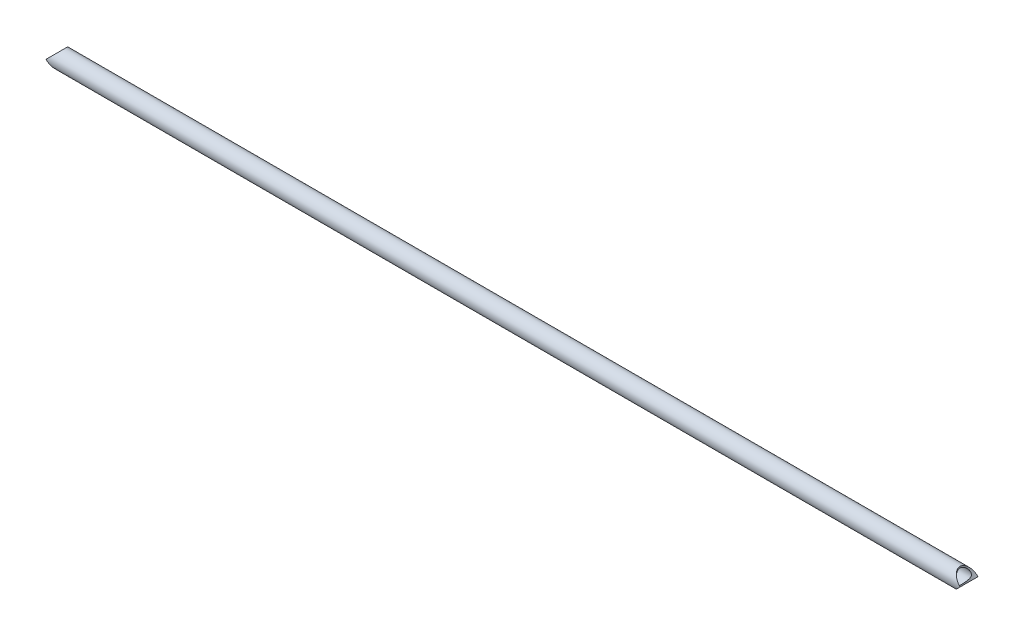
ISO-10303-21;
HEADER;
FILE_DESCRIPTION(('STEP AP214'),'2;1');
FILE_NAME('part.step','',(''),(''),'','','');
FILE_SCHEMA(('AUTOMOTIVE_DESIGN { 1 0 10303 214 1 1 1 1 }'));
ENDSEC;
DATA;
#1=APPLICATION_CONTEXT('core data for automotive mechanical design processes');
#2=APPLICATION_PROTOCOL_DEFINITION('international standard','automotive_design',2000,#1);
#3=PRODUCT_CONTEXT('',#1,'mechanical');
#4=PRODUCT('Part','Part','',(#3));
#5=PRODUCT_RELATED_PRODUCT_CATEGORY('part','',(#4));
#6=PRODUCT_DEFINITION_FORMATION('','',#4);
#7=PRODUCT_DEFINITION_CONTEXT('part definition',#1,'design');
#8=PRODUCT_DEFINITION('design','',#6,#7);
#9=PRODUCT_DEFINITION_SHAPE('','',#8);
#10=(LENGTH_UNIT() NAMED_UNIT(*) SI_UNIT(.MILLI.,.METRE.));
#11=(NAMED_UNIT(*) PLANE_ANGLE_UNIT() SI_UNIT($,.RADIAN.));
#12=(NAMED_UNIT(*) SI_UNIT($,.STERADIAN.) SOLID_ANGLE_UNIT());
#13=UNCERTAINTY_MEASURE_WITH_UNIT(LENGTH_MEASURE(1.E-05),#10,'distance_accuracy_value','');
#14=(GEOMETRIC_REPRESENTATION_CONTEXT(3) GLOBAL_UNCERTAINTY_ASSIGNED_CONTEXT((#13)) GLOBAL_UNIT_ASSIGNED_CONTEXT((#10,
#11,#12)) REPRESENTATION_CONTEXT('',''));
#15=CARTESIAN_POINT('',(0.,0.,0.));
#16=DIRECTION('',(0.,0.,1.));
#17=DIRECTION('',(1.,0.,0.));
#18=AXIS2_PLACEMENT_3D('',#15,#16,#17);
#19=CARTESIAN_POINT('',(0.,0.,0.));
#20=DIRECTION('',(1.,0.,0.));
#21=DIRECTION('',(0.,0.,-1.));
#22=AXIS2_PLACEMENT_3D('',#19,#20,#21);
#23=CYLINDRICAL_SURFACE('',#22,17.526);
#24=CARTESIAN_POINT('',(21.082,-17.526,0.));
#25=CARTESIAN_POINT('',(21.0819981302831,-17.5259980790686,0.416631891884529));
#26=CARTESIAN_POINT('',(21.0696232973525,-17.5111180143844,0.833291614596574));
#27=CARTESIAN_POINT('',(21.0204123868294,-17.4518754486312,1.66306415209241));
#28=CARTESIAN_POINT('',(20.9835740691353,-17.4075102476317,2.07617663854929));
#29=CARTESIAN_POINT('',(20.8862655224406,-17.2900872977812,2.89568705974647));
#30=CARTESIAN_POINT('',(20.8257826629877,-17.2170142136367,3.30208128458832));
#31=CARTESIAN_POINT('',(20.6825199963858,-17.0434440095406,4.10492258594921));
#32=CARTESIAN_POINT('',(20.5997402057583,-16.9429469099098,4.50136966983866));
#33=CARTESIAN_POINT('',(20.4141431070437,-16.7167980768224,5.27944200995072));
#34=CARTESIAN_POINT('',(20.3114495374411,-16.5913015575225,5.66114217998166));
#35=CARTESIAN_POINT('',(20.0876164579014,-16.3165142511288,6.41024393360111));
#36=CARTESIAN_POINT('',(19.9664773273835,-16.1672239534624,6.77764581110572));
#37=CARTESIAN_POINT('',(19.70776489957,-15.8466059374724,7.49671581118125));
#38=CARTESIAN_POINT('',(19.5701899757762,-15.6752760379645,7.84838237183241));
#39=CARTESIAN_POINT('',(19.2806731307627,-15.3122919872886,8.53494244045511));
#40=CARTESIAN_POINT('',(19.1287281642061,-15.1206335269885,8.86983236997341));
#41=CARTESIAN_POINT('',(18.7546096768725,-14.6449371899327,9.64160148099856));
#42=CARTESIAN_POINT('',(18.5270967401216,-14.35277428092,10.0709122769917));
#43=CARTESIAN_POINT('',(18.0542605595369,-13.7370016154288,10.8958994551619));
#44=CARTESIAN_POINT('',(17.8089313166323,-13.4133812541277,11.2915644099101));
#45=CARTESIAN_POINT('',(17.3049499195868,-12.7366562994745,12.0497774892056));
#46=CARTESIAN_POINT('',(17.0462656815009,-12.3834793039229,12.4122394487072));
#47=CARTESIAN_POINT('',(16.5213575682595,-11.6503539028584,13.1028064141256));
#48=CARTESIAN_POINT('',(16.2551346410727,-11.2704088544898,13.4309157156317));
#49=CARTESIAN_POINT('',(15.7157329552894,-10.4776074832354,14.058474508539));
#50=CARTESIAN_POINT('',(15.4425158851042,-10.0642773274174,14.3572922158469));
#51=CARTESIAN_POINT('',(14.9004362017554,-9.21095417180201,14.9191173098571));
#52=CARTESIAN_POINT('',(14.631575071631,-8.77095232335846,15.1821127170899));
#53=CARTESIAN_POINT('',(14.1070581038938,-7.86481771696898,15.6706644706901));
#54=CARTESIAN_POINT('',(13.8513718737821,-7.39875079698375,15.8963099105176));
#55=CARTESIAN_POINT('',(13.3630798731292,-6.43838011624403,16.3089150152554));
#56=CARTESIAN_POINT('',(13.1304544791627,-5.94410093685271,16.4959077210257));
#57=CARTESIAN_POINT('',(12.7988575900592,-5.15602713461917,16.7529770183563));
#58=CARTESIAN_POINT('',(12.6869431717587,-4.87241122579883,16.8377355356669));
#59=CARTESIAN_POINT('',(12.477044564201,-4.29634478402693,16.9938564640281));
#60=CARTESIAN_POINT('',(12.3790621781023,-4.00389311343181,17.0652171414406));
#61=CARTESIAN_POINT('',(12.2002966712012,-3.4112731010736,17.1934753974398));
#62=CARTESIAN_POINT('',(12.1194800845942,-3.11112107688252,17.2504011606098));
#63=CARTESIAN_POINT('',(11.9779668666245,-2.50374825167055,17.3489622221163));
#64=CARTESIAN_POINT('',(11.9172596505075,-2.1965312607242,17.3906055657459));
#65=CARTESIAN_POINT('',(11.818107689882,-1.57275030198951,17.4581423992254));
#66=CARTESIAN_POINT('',(11.779951954164,-1.2561174134265,17.4838316318924));
#67=CARTESIAN_POINT('',(11.7291856587467,-0.619878138777139,17.5179303907999));
#68=CARTESIAN_POINT('',(11.7165727975296,-0.300272023197923,17.5263414738735));
#69=CARTESIAN_POINT('',(11.7176262308081,0.338899727230871,17.5256372420332));
#70=CARTESIAN_POINT('',(11.731294246306,0.658465358058826,17.5165207793285));
#71=CARTESIAN_POINT('',(11.7841114051786,1.29450954509332,17.4810304641374));
#72=CARTESIAN_POINT('',(11.8232637069628,1.61098771371825,17.4546544725793));
#73=CARTESIAN_POINT('',(11.9294258258338,2.26597232429025,17.3822894554488));
#74=CARTESIAN_POINT('',(11.9985895138348,2.60395741877091,17.334774736316));
#75=CARTESIAN_POINT('',(12.1607700214953,3.27094353248153,17.221385971186));
#76=CARTESIAN_POINT('',(12.253790706483,3.59994308630083,17.1555089499647));
#77=CARTESIAN_POINT('',(12.4597518747192,4.24855969720269,17.0065124919798));
#78=CARTESIAN_POINT('',(12.5727445713628,4.56814953492199,16.9233477565931));
#79=CARTESIAN_POINT('',(12.8144967287314,5.19667656849724,16.7410381014441));
#80=CARTESIAN_POINT('',(12.9432623370335,5.50560955027848,16.6418869460964));
#81=CARTESIAN_POINT('',(13.2916030159056,6.28987347341688,16.3663636493324));
#82=CARTESIAN_POINT('',(13.5203444227361,6.75718025521281,16.1786782502658));
#83=CARTESIAN_POINT('',(13.9967739769094,7.66612078661562,15.7683261665334));
#84=CARTESIAN_POINT('',(14.2444730476708,8.10773947286392,15.5456392349102));
#85=CARTESIAN_POINT('',(14.7503773701628,8.966836910621,15.066475124559));
#86=CARTESIAN_POINT('',(15.008596305603,9.38428239246995,14.8099528974554));
#87=CARTESIAN_POINT('',(15.5282832728022,10.1948090672196,14.264122868425));
#88=CARTESIAN_POINT('',(15.789750648598,10.58789508607,13.9748215928149));
#89=CARTESIAN_POINT('',(16.3234130427938,11.3687731946263,13.3482093999188));
#90=CARTESIAN_POINT('',(16.595485056072,11.7553013794754,13.0092142605656));
#91=CARTESIAN_POINT('',(17.1311622254835,12.5001422324198,12.2952548941142));
#92=CARTESIAN_POINT('',(17.3947660938107,12.8584506208612,11.9202852303774));
#93=CARTESIAN_POINT('',(17.9075222183104,13.5440372996657,11.1351119046645));
#94=CARTESIAN_POINT('',(18.156699977354,13.8713710412073,10.7249738116483));
#95=CARTESIAN_POINT('',(18.5157566882301,14.337116723475,10.083528945835));
#96=CARTESIAN_POINT('',(18.6329792519374,14.4881418292696,9.8653649320548));
#97=CARTESIAN_POINT('',(18.8619033923324,14.7813992076686,9.4202948049645));
#98=CARTESIAN_POINT('',(18.9736036059451,14.9236293115641,9.19338655767707));
#99=CARTESIAN_POINT('',(19.245306332261,15.2678710636928,8.6148770358869));
#100=CARTESIAN_POINT('',(19.4013855378835,15.4640216769566,8.25789744735692));
#101=CARTESIAN_POINT('',(19.6969596498739,15.8332690112885,7.52571112583219));
#102=CARTESIAN_POINT('',(19.8364585509682,16.0063712866528,7.15050881408724));
#103=CARTESIAN_POINT('',(20.0964063845014,16.3274115103296,6.38349259773578));
#104=CARTESIAN_POINT('',(20.2168720667449,16.4753715932839,5.99169368811111));
#105=CARTESIAN_POINT('',(20.436574354194,16.7442387882183,5.1931259403282));
#106=CARTESIAN_POINT('',(20.5358135459414,16.8651491964034,4.78635893318676));
#107=CARTESIAN_POINT('',(20.6980175118539,17.0622544046955,4.02147552090746));
#108=CARTESIAN_POINT('',(20.7641757673935,17.1424168859823,3.66505417999647));
#109=CARTESIAN_POINT('',(20.8784528987765,17.2806615676892,2.94511781335948));
#110=CARTESIAN_POINT('',(20.9265738653773,17.3387463272168,2.5816036149305));
#111=CARTESIAN_POINT('',(21.0039231656528,17.4320228512749,1.84968454444555));
#112=CARTESIAN_POINT('',(21.0331534545224,17.4672169849997,1.48128018255334));
#113=CARTESIAN_POINT('',(21.0721936631951,17.5142075700851,0.741924734095827));
#114=CARTESIAN_POINT('',(21.0820016648156,17.5260017104175,0.370973399616664));
#115=CARTESIAN_POINT('',(21.081998130283,17.5259980790686,-0.416631891884526));
#116=CARTESIAN_POINT('',(21.0696232973525,17.5111180143844,-0.83329161459657));
#117=CARTESIAN_POINT('',(21.0204123868294,17.4518754486312,-1.6630641520924));
#118=CARTESIAN_POINT('',(20.9835740691353,17.4075102476317,-2.07617663854929));
#119=CARTESIAN_POINT('',(20.8862655224405,17.2900872977812,-2.89568705974647));
#120=CARTESIAN_POINT('',(20.8257826629877,17.2170142136367,-3.30208128458832));
#121=CARTESIAN_POINT('',(20.6825199963858,17.0434440095406,-4.10492258594921));
#122=CARTESIAN_POINT('',(20.5997402057583,16.9429469099098,-4.50136966983866));
#123=CARTESIAN_POINT('',(20.4141431070437,16.7167980768224,-5.27944200995071));
#124=CARTESIAN_POINT('',(20.3114495374411,16.5913015575225,-5.66114217998166));
#125=CARTESIAN_POINT('',(20.0876164579014,16.3165142511288,-6.41024393360111));
#126=CARTESIAN_POINT('',(19.9664773273835,16.1672239534624,-6.77764581110571));
#127=CARTESIAN_POINT('',(19.70776489957,15.8466059374724,-7.49671581118126));
#128=CARTESIAN_POINT('',(19.5701899757762,15.6752760379645,-7.84838237183241));
#129=CARTESIAN_POINT('',(19.2806731307627,15.3122919872886,-8.53494244045511));
#130=CARTESIAN_POINT('',(19.1287281642061,15.1206335269885,-8.86983236997341));
#131=CARTESIAN_POINT('',(18.7546096768725,14.6449371899327,-9.64160148099856));
#132=CARTESIAN_POINT('',(18.5270967401216,14.35277428092,-10.0709122769917));
#133=CARTESIAN_POINT('',(18.0542605595369,13.7370016154288,-10.8958994551619));
#134=CARTESIAN_POINT('',(17.8089313166323,13.4133812541277,-11.2915644099101));
#135=CARTESIAN_POINT('',(17.3049499195868,12.7366562994745,-12.0497774892056));
#136=CARTESIAN_POINT('',(17.0462656815009,12.3834793039229,-12.4122394487072));
#137=CARTESIAN_POINT('',(16.5213575682595,11.6503539028584,-13.1028064141256));
#138=CARTESIAN_POINT('',(16.2551346410727,11.2704088544898,-13.4309157156317));
#139=CARTESIAN_POINT('',(15.7157329552894,10.4776074832354,-14.058474508539));
#140=CARTESIAN_POINT('',(15.4425158851042,10.0642773274174,-14.3572922158469));
#141=CARTESIAN_POINT('',(14.9004362017554,9.21095417180201,-14.9191173098571));
#142=CARTESIAN_POINT('',(14.631575071631,8.77095232335846,-15.1821127170899));
#143=CARTESIAN_POINT('',(14.1070581038938,7.86481771696898,-15.6706644706901));
#144=CARTESIAN_POINT('',(13.8513718737821,7.39875079698376,-15.8963099105176));
#145=CARTESIAN_POINT('',(13.3630798731292,6.43838011624403,-16.3089150152554));
#146=CARTESIAN_POINT('',(13.1304544791627,5.94410093685271,-16.4959077210257));
#147=CARTESIAN_POINT('',(12.7988575900592,5.15602713461916,-16.7529770183563));
#148=CARTESIAN_POINT('',(12.6869431717587,4.87241122579883,-16.8377355356669));
#149=CARTESIAN_POINT('',(12.477044564201,4.29634478402693,-16.9938564640281));
#150=CARTESIAN_POINT('',(12.3790621781024,4.00389311343181,-17.0652171414406));
#151=CARTESIAN_POINT('',(12.2002966712012,3.41127310107359,-17.1934753974398));
#152=CARTESIAN_POINT('',(12.1194800845942,3.11112107688251,-17.2504011606098));
#153=CARTESIAN_POINT('',(11.9779668666245,2.50374825167054,-17.3489622221163));
#154=CARTESIAN_POINT('',(11.9172596505075,2.1965312607242,-17.3906055657459));
#155=CARTESIAN_POINT('',(11.818107689882,1.57275030198951,-17.4581423992254));
#156=CARTESIAN_POINT('',(11.779951954164,1.25611741342649,-17.4838316318924));
#157=CARTESIAN_POINT('',(11.7291856587467,0.619878138777128,-17.5179303907999));
#158=CARTESIAN_POINT('',(11.7165727975296,0.300272023197912,-17.5263414738735));
#159=CARTESIAN_POINT('',(11.7176262308081,-0.338899727230883,-17.5256372420332));
#160=CARTESIAN_POINT('',(11.731294246306,-0.658465358058837,-17.5165207793285));
#161=CARTESIAN_POINT('',(11.7841114051786,-1.29450954509333,-17.4810304641374));
#162=CARTESIAN_POINT('',(11.8232637069628,-1.61098771371825,-17.4546544725793));
#163=CARTESIAN_POINT('',(11.9294258258338,-2.26597232429026,-17.3822894554488));
#164=CARTESIAN_POINT('',(11.9985895138348,-2.60395741877093,-17.334774736316));
#165=CARTESIAN_POINT('',(12.1607700214953,-3.27094353248155,-17.221385971186));
#166=CARTESIAN_POINT('',(12.2537907064831,-3.59994308630085,-17.1555089499647));
#167=CARTESIAN_POINT('',(12.4597518747192,-4.24855969720271,-17.0065124919798));
#168=CARTESIAN_POINT('',(12.5727445713628,-4.568149534922,-16.9233477565931));
#169=CARTESIAN_POINT('',(12.8144967287314,-5.19667656849725,-16.741038101444));
#170=CARTESIAN_POINT('',(12.9432623370335,-5.50560955027849,-16.6418869460964));
#171=CARTESIAN_POINT('',(13.2916030159056,-6.28987347341688,-16.3663636493324));
#172=CARTESIAN_POINT('',(13.5203444227361,-6.75718025521282,-16.1786782502658));
#173=CARTESIAN_POINT('',(13.9967739769094,-7.66612078661563,-15.7683261665334));
#174=CARTESIAN_POINT('',(14.2444730476708,-8.10773947286393,-15.5456392349102));
#175=CARTESIAN_POINT('',(14.7503773701628,-8.966836910621,-15.066475124559));
#176=CARTESIAN_POINT('',(15.008596305603,-9.38428239246996,-14.8099528974554));
#177=CARTESIAN_POINT('',(15.5282832728022,-10.1948090672196,-14.2641228684251));
#178=CARTESIAN_POINT('',(15.789750648598,-10.58789508607,-13.9748215928149));
#179=CARTESIAN_POINT('',(16.3234130427938,-11.3687731946263,-13.3482093999188));
#180=CARTESIAN_POINT('',(16.595485056072,-11.7553013794754,-13.0092142605656));
#181=CARTESIAN_POINT('',(17.1311622254835,-12.5001422324198,-12.2952548941142));
#182=CARTESIAN_POINT('',(17.3947660938107,-12.8584506208612,-11.9202852303774));
#183=CARTESIAN_POINT('',(17.9075222183104,-13.5440372996657,-11.1351119046645));
#184=CARTESIAN_POINT('',(18.156699977354,-13.8713710412073,-10.7249738116483));
#185=CARTESIAN_POINT('',(18.5157566882301,-14.337116723475,-10.083528945835));
#186=CARTESIAN_POINT('',(18.6329792519374,-14.4881418292696,-9.8653649320548));
#187=CARTESIAN_POINT('',(18.8619033923324,-14.7813992076686,-9.4202948049645));
#188=CARTESIAN_POINT('',(18.9736036059451,-14.9236293115641,-9.19338655767707));
#189=CARTESIAN_POINT('',(19.245306332261,-15.2678710636928,-8.6148770358869));
#190=CARTESIAN_POINT('',(19.4013855378835,-15.4640216769566,-8.25789744735693));
#191=CARTESIAN_POINT('',(19.6969596498739,-15.8332690112885,-7.52571112583219));
#192=CARTESIAN_POINT('',(19.8364585509682,-16.0063712866528,-7.15050881408724));
#193=CARTESIAN_POINT('',(20.0964063845014,-16.3274115103296,-6.38349259773578));
#194=CARTESIAN_POINT('',(20.2168720667449,-16.4753715932839,-5.99169368811112));
#195=CARTESIAN_POINT('',(20.436574354194,-16.7442387882182,-5.1931259403282));
#196=CARTESIAN_POINT('',(20.5358135459414,-16.8651491964034,-4.78635893318676));
#197=CARTESIAN_POINT('',(20.6980175118538,-17.0622544046955,-4.02147552090746));
#198=CARTESIAN_POINT('',(20.7641757673935,-17.1424168859823,-3.66505417999648));
#199=CARTESIAN_POINT('',(20.8784528987765,-17.2806615676892,-2.94511781335949));
#200=CARTESIAN_POINT('',(20.9265738653773,-17.3387463272168,-2.5816036149305));
#201=CARTESIAN_POINT('',(21.0039231656528,-17.4320228512749,-1.84968454444556));
#202=CARTESIAN_POINT('',(21.0331534545224,-17.4672169849997,-1.48128018255334));
#203=CARTESIAN_POINT('',(21.0721936631951,-17.5142075700851,-0.741924734095828));
#204=CARTESIAN_POINT('',(21.0820016648155,-17.5260017104175,-0.370973399616663));
#205=CARTESIAN_POINT('',(21.082,-17.526,0.));
#206=B_SPLINE_CURVE_WITH_KNOTS('',3,(#24,#25,#26,#27,#28,#29,#30,#31,#32,#33,#34,#35,#36,#37,
#38,#39,#40,#41,#42,#43,#44,#45,#46,#47,#48,#49,#50,#51,#52,#53,#54,#55,#56,#57,#58,#59,#60,#61,
#62,#63,#64,#65,#66,#67,#68,#69,#70,#71,#72,#73,#74,#75,#76,#77,#78,#79,#80,#81,#82,#83,#84,#85,
#86,#87,#88,#89,#90,#91,#92,#93,#94,#95,#96,#97,#98,#99,#100,#101,#102,#103,#104,#105,#106,#107,
#108,#109,#110,#111,#112,#113,#114,#115,#116,#117,#118,#119,#120,#121,#122,#123,#124,#125,#126,
#127,#128,#129,#130,#131,#132,#133,#134,#135,#136,#137,#138,#139,#140,#141,#142,#143,#144,#145,
#146,#147,#148,#149,#150,#151,#152,#153,#154,#155,#156,#157,#158,#159,#160,#161,#162,#163,#164,
#165,#166,#167,#168,#169,#170,#171,#172,#173,#174,#175,#176,#177,#178,#179,#180,#181,#182,#183,
#184,#185,#186,#187,#188,#189,#190,#191,#192,#193,#194,#195,#196,#197,#198,#199,#200,#201,#202,
#203,#204,#205),.UNSPECIFIED.,.T.,.F.,(4,2,2,2,2,2,2,2,2,2,2,2,2,2,2,2,2,2,2,2,2,2,2,2,2,2,2,2,
2,2,2,2,2,2,2,2,2,2,2,2,2,2,2,2,2,2,2,2,2,2,2,2,2,2,2,2,2,2,2,2,2,2,2,2,2,2,2,2,2,2,2,2,2,2,2,2,
2,2,2,2,2,2,2,2,2,2,2,2,2,2,4),(0.,1.24949934855756,2.49911312853975,3.74939534191412,
4.99967662885311,6.24242452622056,7.48514686411975,8.72799228476734,9.97110168518414,
11.669501012606,13.3684748971782,15.0717397764303,16.7747914178441,18.5089011871743,
20.243589450297,21.974078274241,23.7030816801075,24.6518793393344,25.600799685493,
26.5478527179048,27.4944064650862,28.4528415801625,29.4111903324619,30.3696018443357,
31.328132160104,32.3712695138644,33.4145759843964,34.4606514688156,35.5071359718705,
37.1638896134146,38.8216051704627,40.4815505217246,42.1411659563,43.8843738766099,
45.6278456548924,47.3681347383873,48.2380995270287,49.1082779868029,50.4155878903855,
51.7225821799055,53.0284197904999,54.3340981882378,55.4467998172027,56.5593724295939,
57.6718298716841,58.7843971767374,60.0338965252949,61.2835103052771,62.5337925186515,
63.7840738055905,65.0268217029579,66.2695440408571,67.5123894615047,68.7554988619215,
70.4538981893433,72.1528720739155,73.8561369531677,75.5591885945815,77.2932983639116,
79.0279866270344,80.7584754509784,82.4874788568449,83.4362765160718,84.3851968622304,
85.3322498946422,86.2788036418235,87.2372387568998,88.1955875091993,89.153999021073,
90.1125293368414,91.1556666906017,92.1989731611338,93.245048645553,94.2915331486079,
95.948286790152,97.6060023472001,99.2659476984619,100.925563133037,102.668771053347,
104.41224283163,106.152531915125,107.022496703766,107.89267516354,109.199985067123,
110.506979356643,111.812816967237,113.118495364975,114.23119699394,115.343769606331,
116.456227048421,117.568794353475),.UNSPECIFIED.);
#207=CARTESIAN_POINT('',(21.082,-17.526,0.));
#208=VERTEX_POINT('',#207);
#209=EDGE_CURVE('E20',#208,#208,#206,.T.);
#210=ORIENTED_EDGE('',*,*,#209,.T.);
#211=EDGE_LOOP('',(#210));
#212=FACE_BOUND('',#211,.T.);
#213=CARTESIAN_POINT('',(2122.17,17.526,0.));
#214=CARTESIAN_POINT('',(2122.17000186972,17.5259980790686,0.416631891884531));
#215=CARTESIAN_POINT('',(2122.18237670265,17.5111180143844,0.83329161459659));
#216=CARTESIAN_POINT('',(2122.23158761317,17.4518754486312,1.66306415209244));
#217=CARTESIAN_POINT('',(2122.26842593086,17.4075102476317,2.07617663854933));
#218=CARTESIAN_POINT('',(2122.36573447756,17.2900872977812,2.89568705974649));
#219=CARTESIAN_POINT('',(2122.42621733701,17.2170142136367,3.30208128458833));
#220=CARTESIAN_POINT('',(2122.56948000361,17.0434440095406,4.1049225859492));
#221=CARTESIAN_POINT('',(2122.65225979424,16.9429469099098,4.50136966983867));
#222=CARTESIAN_POINT('',(2122.83785689296,16.7167980768224,5.27944200995073));
#223=CARTESIAN_POINT('',(2122.94055046256,16.5913015575225,5.66114217998168));
#224=CARTESIAN_POINT('',(2123.1643835421,16.3165142511288,6.41024393360115));
#225=CARTESIAN_POINT('',(2123.28552267262,16.1672239534624,6.77764581110577));
#226=CARTESIAN_POINT('',(2123.54423510043,15.8466059374724,7.4967158111813));
#227=CARTESIAN_POINT('',(2123.68181002422,15.6752760379645,7.84838237183243));
#228=CARTESIAN_POINT('',(2123.97132686924,15.3122919872886,8.53494244045513));
#229=CARTESIAN_POINT('',(2124.12327183579,15.1206335269885,8.86983236997345));
#230=CARTESIAN_POINT('',(2124.49739032313,14.6449371899327,9.64160148099861));
#231=CARTESIAN_POINT('',(2124.72490325988,14.35277428092,10.0709122769917));
#232=CARTESIAN_POINT('',(2125.19773944046,13.7370016154288,10.8958994551619));
#233=CARTESIAN_POINT('',(2125.44306868337,13.4133812541277,11.2915644099101));
#234=CARTESIAN_POINT('',(2125.94705008041,12.7366562994745,12.0497774892056));
#235=CARTESIAN_POINT('',(2126.2057343185,12.3834793039229,12.4122394487071));
#236=CARTESIAN_POINT('',(2126.73064243174,11.6503539028584,13.1028064141256));
#237=CARTESIAN_POINT('',(2126.99686535893,11.2704088544897,13.4309157156317));
#238=CARTESIAN_POINT('',(2127.53626704471,10.4776074832353,14.058474508539));
#239=CARTESIAN_POINT('',(2127.8094841149,10.0642773274173,14.3572922158469));
#240=CARTESIAN_POINT('',(2128.35156379825,9.21095417180199,14.9191173098571));
#241=CARTESIAN_POINT('',(2128.62042492837,8.77095232335845,15.1821127170899));
#242=CARTESIAN_POINT('',(2129.14494189611,7.86481771696897,15.6706644706901));
#243=CARTESIAN_POINT('',(2129.40062812622,7.39875079698372,15.8963099105177));
#244=CARTESIAN_POINT('',(2129.88892012687,6.43838011624397,16.3089150152554));
#245=CARTESIAN_POINT('',(2130.12154552084,5.94410093685263,16.4959077210258));
#246=CARTESIAN_POINT('',(2130.45314240994,5.15602713461896,16.7529770183564));
#247=CARTESIAN_POINT('',(2130.56505682824,4.87241122579861,16.837735535667));
#248=CARTESIAN_POINT('',(2130.7749554358,4.29634478402666,16.9938564640282));
#249=CARTESIAN_POINT('',(2130.8729378219,4.00389311343152,17.0652171414407));
#250=CARTESIAN_POINT('',(2131.0517033288,3.41127310107328,17.1934753974399));
#251=CARTESIAN_POINT('',(2131.13251991541,3.1111210768822,17.2504011606098));
#252=CARTESIAN_POINT('',(2131.27403313338,2.50374825167022,17.3489622221164));
#253=CARTESIAN_POINT('',(2131.33474034949,2.19653126072388,17.390605565746));
#254=CARTESIAN_POINT('',(2131.43389231012,1.5727503019892,17.4581423992255));
#255=CARTESIAN_POINT('',(2131.47204804584,1.25611741342618,17.4838316318924));
#256=CARTESIAN_POINT('',(2131.52281434125,0.619878138776815,17.5179303907999));
#257=CARTESIAN_POINT('',(2131.53542720247,0.300272023197598,17.5263414738735));
#258=CARTESIAN_POINT('',(2131.53437376919,-0.338899727231186,17.5256372420332));
#259=CARTESIAN_POINT('',(2131.52070575369,-0.65846535805913,17.5165207793285));
#260=CARTESIAN_POINT('',(2131.46788859482,-1.29450954509362,17.4810304641373));
#261=CARTESIAN_POINT('',(2131.42873629304,-1.61098771371855,17.4546544725793));
#262=CARTESIAN_POINT('',(2131.32257417417,-2.26597232429054,17.3822894554487));
#263=CARTESIAN_POINT('',(2131.25341048617,-2.60395741877116,17.334774736316));
#264=CARTESIAN_POINT('',(2131.0912299785,-3.27094353248179,17.2213859711859));
#265=CARTESIAN_POINT('',(2130.99820929352,-3.59994308630113,17.1555089499646));
#266=CARTESIAN_POINT('',(2130.79224812528,-4.24855969720303,17.0065124919797));
#267=CARTESIAN_POINT('',(2130.67925542864,-4.56814953492233,16.923347756593));
#268=CARTESIAN_POINT('',(2130.43750327127,-5.19667656849758,16.7410381014439));
#269=CARTESIAN_POINT('',(2130.30873766297,-5.50560955027882,16.6418869460962));
#270=CARTESIAN_POINT('',(2129.96039698409,-6.28987347341731,16.3663636493323));
#271=CARTESIAN_POINT('',(2129.73165557726,-6.75718025521334,16.1786782502656));
#272=CARTESIAN_POINT('',(2129.25522602309,-7.66612078661626,15.7683261665331));
#273=CARTESIAN_POINT('',(2129.00752695233,-8.10773947286456,15.5456392349099));
#274=CARTESIAN_POINT('',(2128.50162262984,-8.96683691062164,15.0664751245586));
#275=CARTESIAN_POINT('',(2128.2434036944,-9.3842823924706,14.809952897455));
#276=CARTESIAN_POINT('',(2127.7237167272,-10.1948090672202,14.2641228684246));
#277=CARTESIAN_POINT('',(2127.4622493514,-10.5878950860707,13.9748215928143));
#278=CARTESIAN_POINT('',(2126.92858695721,-11.368773194627,13.3482093999182));
#279=CARTESIAN_POINT('',(2126.65651494393,-11.7553013794761,13.009214260565));
#280=CARTESIAN_POINT('',(2126.12083777452,-12.5001422324204,12.2952548941136));
#281=CARTESIAN_POINT('',(2125.85723390619,-12.8584506208618,11.9202852303767));
#282=CARTESIAN_POINT('',(2125.34447778169,-13.5440372996663,11.1351119046638));
#283=CARTESIAN_POINT('',(2125.09530002265,-13.8713710412078,10.7249738116476));
#284=CARTESIAN_POINT('',(2124.73624331177,-14.3371167234756,10.0835289458343));
#285=CARTESIAN_POINT('',(2124.61902074806,-14.4881418292702,9.86536493205398));
#286=CARTESIAN_POINT('',(2124.39009660767,-14.7813992076691,9.42029480496362));
#287=CARTESIAN_POINT('',(2124.27839639405,-14.9236293115647,9.19338655767616));
#288=CARTESIAN_POINT('',(2124.00669366774,-15.2678710636933,8.61487703588599));
#289=CARTESIAN_POINT('',(2123.85061446212,-15.4640216769571,8.25789744735605));
#290=CARTESIAN_POINT('',(2123.55504035013,-15.8332690112889,7.52571112583131));
#291=CARTESIAN_POINT('',(2123.41554144903,-16.0063712866532,7.15050881408632));
#292=CARTESIAN_POINT('',(2123.1555936155,-16.32741151033,6.38349259773477));
#293=CARTESIAN_POINT('',(2123.03512793325,-16.4753715932843,5.99169368811006));
#294=CARTESIAN_POINT('',(2122.81542564581,-16.7442387882186,5.19312594032714));
#295=CARTESIAN_POINT('',(2122.71618645406,-16.8651491964036,4.78635893318576));
#296=CARTESIAN_POINT('',(2122.55398248815,-17.0622544046957,4.02147552090656));
#297=CARTESIAN_POINT('',(2122.48782423261,-17.1424168859824,3.66505417999562));
#298=CARTESIAN_POINT('',(2122.37354710122,-17.2806615676893,2.94511781335881));
#299=CARTESIAN_POINT('',(2122.32542613462,-17.3387463272168,2.58160361492994));
#300=CARTESIAN_POINT('',(2122.24807683435,-17.4320228512749,1.8496845444452));
#301=CARTESIAN_POINT('',(2122.21884654548,-17.4672169849997,1.48128018255307));
#302=CARTESIAN_POINT('',(2122.17980633681,-17.5142075700851,0.741924734095749));
#303=CARTESIAN_POINT('',(2122.16999833518,-17.5260017104175,0.370973399616687));
#304=CARTESIAN_POINT('',(2122.17000186972,-17.5259980790686,-0.416631891884416));
#305=CARTESIAN_POINT('',(2122.18237670265,-17.5111180143844,-0.833291614596478));
#306=CARTESIAN_POINT('',(2122.23158761317,-17.4518754486312,-1.66306415209232));
#307=CARTESIAN_POINT('',(2122.26842593086,-17.4075102476317,-2.07617663854919));
#308=CARTESIAN_POINT('',(2122.36573447756,-17.2900872977813,-2.89568705974636));
#309=CARTESIAN_POINT('',(2122.42621733701,-17.2170142136367,-3.30208128458823));
#310=CARTESIAN_POINT('',(2122.56948000361,-17.0434440095406,-4.10492258594916));
#311=CARTESIAN_POINT('',(2122.65225979424,-16.9429469099098,-4.50136966983865));
#312=CARTESIAN_POINT('',(2122.83785689296,-16.7167980768224,-5.27944200995074));
#313=CARTESIAN_POINT('',(2122.94055046256,-16.5913015575225,-5.66114217998169));
#314=CARTESIAN_POINT('',(2123.1643835421,-16.3165142511288,-6.41024393360115));
#315=CARTESIAN_POINT('',(2123.28552267262,-16.1672239534624,-6.77764581110577));
#316=CARTESIAN_POINT('',(2123.54423510043,-15.8466059374724,-7.4967158111813));
#317=CARTESIAN_POINT('',(2123.68181002422,-15.6752760379645,-7.84838237183243));
#318=CARTESIAN_POINT('',(2123.97132686924,-15.3122919872885,-8.53494244045513));
#319=CARTESIAN_POINT('',(2124.12327183579,-15.1206335269885,-8.86983236997346));
#320=CARTESIAN_POINT('',(2124.49739032313,-14.6449371899327,-9.64160148099861));
#321=CARTESIAN_POINT('',(2124.72490325988,-14.35277428092,-10.0709122769917));
#322=CARTESIAN_POINT('',(2125.19773944046,-13.7370016154288,-10.8958994551619));
#323=CARTESIAN_POINT('',(2125.44306868337,-13.4133812541277,-11.2915644099101));
#324=CARTESIAN_POINT('',(2125.94705008041,-12.7366562994745,-12.0497774892056));
#325=CARTESIAN_POINT('',(2126.2057343185,-12.3834793039229,-12.4122394487071));
#326=CARTESIAN_POINT('',(2126.73064243174,-11.6503539028584,-13.1028064141256));
#327=CARTESIAN_POINT('',(2126.99686535893,-11.2704088544897,-13.4309157156317));
#328=CARTESIAN_POINT('',(2127.53626704471,-10.4776074832353,-14.058474508539));
#329=CARTESIAN_POINT('',(2127.8094841149,-10.0642773274173,-14.3572922158469));
#330=CARTESIAN_POINT('',(2128.35156379825,-9.21095417180199,-14.9191173098571));
#331=CARTESIAN_POINT('',(2128.62042492837,-8.77095232335845,-15.1821127170899));
#332=CARTESIAN_POINT('',(2129.14494189611,-7.86481771696897,-15.6706644706901));
#333=CARTESIAN_POINT('',(2129.40062812622,-7.39875079698372,-15.8963099105177));
#334=CARTESIAN_POINT('',(2129.88892012687,-6.43838011624396,-16.3089150152554));
#335=CARTESIAN_POINT('',(2130.12154552084,-5.94410093685263,-16.4959077210258));
#336=CARTESIAN_POINT('',(2130.45314240994,-5.15602713461896,-16.7529770183564));
#337=CARTESIAN_POINT('',(2130.56505682824,-4.87241122579861,-16.837735535667));
#338=CARTESIAN_POINT('',(2130.7749554358,-4.29634478402666,-16.9938564640282));
#339=CARTESIAN_POINT('',(2130.8729378219,-4.00389311343153,-17.0652171414407));
#340=CARTESIAN_POINT('',(2131.0517033288,-3.41127310107328,-17.1934753974399));
#341=CARTESIAN_POINT('',(2131.13251991541,-3.1111210768822,-17.2504011606098));
#342=CARTESIAN_POINT('',(2131.27403313338,-2.50374825167023,-17.3489622221164));
#343=CARTESIAN_POINT('',(2131.33474034949,-2.19653126072389,-17.390605565746));
#344=CARTESIAN_POINT('',(2131.43389231012,-1.5727503019892,-17.4581423992255));
#345=CARTESIAN_POINT('',(2131.47204804584,-1.25611741342618,-17.4838316318924));
#346=CARTESIAN_POINT('',(2131.52281434125,-0.619878138776812,-17.5179303907999));
#347=CARTESIAN_POINT('',(2131.53542720247,-0.300272023197595,-17.5263414738735));
#348=CARTESIAN_POINT('',(2131.53437376919,0.338899727231211,-17.5256372420332));
#349=CARTESIAN_POINT('',(2131.52070575369,0.658465358059176,-17.5165207793285));
#350=CARTESIAN_POINT('',(2131.46788859482,1.29450954509366,-17.4810304641373));
#351=CARTESIAN_POINT('',(2131.42873629304,1.61098771371858,-17.4546544725793));
#352=CARTESIAN_POINT('',(2131.32257417417,2.26597232429053,-17.3822894554487));
#353=CARTESIAN_POINT('',(2131.25341048617,2.60395741877115,-17.334774736316));
#354=CARTESIAN_POINT('',(2131.0912299785,3.27094353248178,-17.2213859711859));
#355=CARTESIAN_POINT('',(2130.99820929352,3.59994308630112,-17.1555089499646));
#356=CARTESIAN_POINT('',(2130.79224812528,4.24855969720303,-17.0065124919797));
#357=CARTESIAN_POINT('',(2130.67925542864,4.56814953492232,-16.923347756593));
#358=CARTESIAN_POINT('',(2130.43750327127,5.19667656849758,-16.7410381014439));
#359=CARTESIAN_POINT('',(2130.30873766297,5.50560955027882,-16.6418869460962));
#360=CARTESIAN_POINT('',(2129.96039698409,6.28987347341726,-16.3663636493323));
#361=CARTESIAN_POINT('',(2129.73165557726,6.75718025521325,-16.1786782502656));
#362=CARTESIAN_POINT('',(2129.25522602309,7.66612078661601,-15.7683261665332));
#363=CARTESIAN_POINT('',(2129.00752695233,8.10773947286422,-15.54563923491));
#364=CARTESIAN_POINT('',(2128.50162262984,8.9668369106213,-15.0664751245588));
#365=CARTESIAN_POINT('',(2128.2434036944,9.38428239247036,-14.8099528974551));
#366=CARTESIAN_POINT('',(2127.7237167272,10.1948090672201,-14.2641228684246));
#367=CARTESIAN_POINT('',(2127.4622493514,10.5878950860707,-13.9748215928143));
#368=CARTESIAN_POINT('',(2126.92858695721,11.368773194627,-13.3482093999182));
#369=CARTESIAN_POINT('',(2126.65651494393,11.7553013794761,-13.009214260565));
#370=CARTESIAN_POINT('',(2126.12083777452,12.5001422324204,-12.2952548941136));
#371=CARTESIAN_POINT('',(2125.85723390619,12.8584506208618,-11.9202852303767));
#372=CARTESIAN_POINT('',(2125.34447778169,13.5440372996663,-11.1351119046638));
#373=CARTESIAN_POINT('',(2125.09530002265,13.8713710412078,-10.7249738116476));
#374=CARTESIAN_POINT('',(2124.73624331177,14.3371167234756,-10.0835289458343));
#375=CARTESIAN_POINT('',(2124.61902074806,14.4881418292701,-9.86536493205399));
#376=CARTESIAN_POINT('',(2124.39009660767,14.7813992076691,-9.42029480496362));
#377=CARTESIAN_POINT('',(2124.27839639405,14.9236293115647,-9.19338655767616));
#378=CARTESIAN_POINT('',(2124.00669366774,15.2678710636933,-8.614877035886));
#379=CARTESIAN_POINT('',(2123.85061446212,15.4640216769571,-8.25789744735605));
#380=CARTESIAN_POINT('',(2123.55504035013,15.8332690112889,-7.52571112583131));
#381=CARTESIAN_POINT('',(2123.41554144903,16.0063712866532,-7.15050881408632));
#382=CARTESIAN_POINT('',(2123.1555936155,16.32741151033,-6.38349259773477));
#383=CARTESIAN_POINT('',(2123.03512793325,16.4753715932843,-5.99169368811005));
#384=CARTESIAN_POINT('',(2122.81542564581,16.7442387882186,-5.19312594032714));
#385=CARTESIAN_POINT('',(2122.71618645406,16.8651491964036,-4.78635893318576));
#386=CARTESIAN_POINT('',(2122.55398248815,17.0622544046957,-4.02147552090655));
#387=CARTESIAN_POINT('',(2122.48782423261,17.1424168859824,-3.6650541799956));
#388=CARTESIAN_POINT('',(2122.37354710122,17.2806615676893,-2.94511781335877));
#389=CARTESIAN_POINT('',(2122.32542613462,17.3387463272169,-2.58160361492989));
#390=CARTESIAN_POINT('',(2122.24807683435,17.4320228512749,-1.84968454444514));
#391=CARTESIAN_POINT('',(2122.21884654548,17.4672169849997,-1.481280182553));
#392=CARTESIAN_POINT('',(2122.17980633681,17.5142075700851,-0.741924734095659));
#393=CARTESIAN_POINT('',(2122.16999833518,17.5260017104175,-0.370973399616584));
#394=CARTESIAN_POINT('',(2122.17,17.526,0.));
#395=B_SPLINE_CURVE_WITH_KNOTS('',3,(#213,#214,#215,#216,#217,#218,#219,#220,#221,#222,#223,
#224,#225,#226,#227,#228,#229,#230,#231,#232,#233,#234,#235,#236,#237,#238,#239,#240,#241,#242,
#243,#244,#245,#246,#247,#248,#249,#250,#251,#252,#253,#254,#255,#256,#257,#258,#259,#260,#261,
#262,#263,#264,#265,#266,#267,#268,#269,#270,#271,#272,#273,#274,#275,#276,#277,#278,#279,#280,
#281,#282,#283,#284,#285,#286,#287,#288,#289,#290,#291,#292,#293,#294,#295,#296,#297,#298,#299,
#300,#301,#302,#303,#304,#305,#306,#307,#308,#309,#310,#311,#312,#313,#314,#315,#316,#317,#318,
#319,#320,#321,#322,#323,#324,#325,#326,#327,#328,#329,#330,#331,#332,#333,#334,#335,#336,#337,
#338,#339,#340,#341,#342,#343,#344,#345,#346,#347,#348,#349,#350,#351,#352,#353,#354,#355,#356,
#357,#358,#359,#360,#361,#362,#363,#364,#365,#366,#367,#368,#369,#370,#371,#372,#373,#374,#375,
#376,#377,#378,#379,#380,#381,#382,#383,#384,#385,#386,#387,#388,#389,#390,#391,#392,#393,#394),
.UNSPECIFIED.,.T.,.F.,(4,2,2,2,2,2,2,2,2,2,2,2,2,2,2,2,2,2,2,2,2,2,2,2,2,2,2,2,2,2,2,2,2,2,2,2,
2,2,2,2,2,2,2,2,2,2,2,2,2,2,2,2,2,2,2,2,2,2,2,2,2,2,2,2,2,2,2,2,2,2,2,2,2,2,2,2,2,2,2,2,2,2,2,2,
2,2,2,2,2,2,4),(0.,1.24949934855758,2.49911312853981,3.74939534191413,4.9996766288531,
6.24242452622061,7.48514686411984,8.72799228476747,9.97110168518416,11.6695010126059,
13.3684748971781,15.0717397764302,16.7747914178442,18.5089011871744,20.243589450297,
21.9740782742411,23.7030816801079,24.6518793393347,25.6007996854933,26.5478527179052,
27.4944064650865,28.4528415801628,29.4111903324622,30.369601844336,31.3281321601043,
32.3712695138646,33.4145759843968,34.4606514688161,35.507135971871,37.1638896134153,
38.8216051704635,40.4815505217254,42.1411659563011,43.8843738766108,45.6278456548933,
47.3681347383884,48.2380995270298,49.1082779868041,50.4155878903864,51.7225821799066,
53.028419790501,54.3340981882389,55.4467998172035,56.5593724295944,57.6718298716843,
58.7843971767372,60.0338965252948,61.283510305277,62.5337925186514,63.7840738055905,
65.026821702958,66.2695440408572,67.5123894615048,68.7554988619215,70.4538981893432,
72.1528720739154,73.8561369531676,75.5591885945815,77.2932983639118,79.0279866270344,
80.7584754509784,82.4874788568452,83.436276516072,84.3851968622306,85.3322498946426,
86.2788036418238,87.2372387569002,88.1955875091996,89.1539990210734,90.1125293368417,
91.1556666906019,92.1989731611341,93.2450486455535,94.2915331486084,95.9482867901525,
97.6060023472005,99.2659476984626,100.925563133038,102.668771053348,104.412242831631,
106.152531915126,107.022496703767,107.892675163541,109.199985067124,110.506979356644,
111.812816967238,113.118495364976,114.231196993941,115.343769606332,116.456227048422,
117.568794353475),.UNSPECIFIED.);
#396=CARTESIAN_POINT('',(2122.17,17.526,0.));
#397=VERTEX_POINT('',#396);
#398=EDGE_CURVE('E48',#397,#397,#395,.T.);
#399=ORIENTED_EDGE('',*,*,#398,.T.);
#400=EDGE_LOOP('',(#399));
#401=FACE_BOUND('',#400,.T.);
#402=ADVANCED_FACE('F16',(#212,#401),#23,.F.);
#403=CARTESIAN_POINT('',(0.,-25.2984,0.));
#404=DIRECTION('',(0.,1.,0.));
#405=DIRECTION('',(0.,0.,1.));
#406=AXIS2_PLACEMENT_3D('',#403,#404,#405);
#407=CYLINDRICAL_SURFACE('',#406,21.082);
#408=ORIENTED_EDGE('',*,*,#209,.F.);
#409=EDGE_LOOP('',(#408));
#410=FACE_BOUND('',#409,.T.);
#411=CARTESIAN_POINT('',(0.,0.,0.));
#412=DIRECTION('',(0.707106781186547,0.707106781186547,0.));
#413=DIRECTION('',(-0.707106781186547,0.707106781186547,0.));
#414=AXIS2_PLACEMENT_3D('',#411,#412,#413);
#415=ELLIPSE('',#414,29.8144503219496,21.082);
#416=CARTESIAN_POINT('',(0.,0.,21.082));
#417=VERTEX_POINT('',#416);
#418=CARTESIAN_POINT('',(0.,0.,-21.082));
#419=VERTEX_POINT('',#418);
#420=EDGE_CURVE('E46',#417,#419,#415,.T.);
#421=ORIENTED_EDGE('',*,*,#420,.F.);
#422=CARTESIAN_POINT('',(0.,0.,0.));
#423=DIRECTION('',(-0.707106781186547,0.707106781186547,0.));
#424=DIRECTION('',(0.707106781186547,0.707106781186547,0.));
#425=AXIS2_PLACEMENT_3D('',#422,#423,#424);
#426=ELLIPSE('',#425,29.8144503219496,21.082);
#427=EDGE_CURVE('E43',#419,#417,#426,.F.);
#428=ORIENTED_EDGE('',*,*,#427,.F.);
#429=EDGE_LOOP('',(#421,#428));
#430=FACE_BOUND('',#429,.T.);
#431=ADVANCED_FACE('F45',(#410,#430),#407,.F.);
#432=CARTESIAN_POINT('',(2143.252,-25.2984,0.));
#433=DIRECTION('',(0.,1.,0.));
#434=DIRECTION('',(0.,0.,1.));
#435=AXIS2_PLACEMENT_3D('',#432,#433,#434);
#436=CYLINDRICAL_SURFACE('',#435,21.082);
#437=ORIENTED_EDGE('',*,*,#398,.F.);
#438=EDGE_LOOP('',(#437));
#439=FACE_BOUND('',#438,.T.);
#440=CARTESIAN_POINT('',(2143.252,0.,0.));
#441=DIRECTION('',(0.707106781186547,0.707106781186547,0.));
#442=DIRECTION('',(-0.707106781186547,0.707106781186547,0.));
#443=AXIS2_PLACEMENT_3D('',#440,#441,#442);
#444=ELLIPSE('',#443,29.8144503219496,21.082);
#445=CARTESIAN_POINT('',(2143.252,0.,21.082));
#446=VERTEX_POINT('',#445);
#447=CARTESIAN_POINT('',(2143.252,0.,-21.082));
#448=VERTEX_POINT('',#447);
#449=EDGE_CURVE('E11',#446,#448,#444,.F.);
#450=ORIENTED_EDGE('',*,*,#449,.F.);
#451=CARTESIAN_POINT('',(2143.252,0.,0.));
#452=DIRECTION('',(-0.707106781186547,0.707106781186547,0.));
#453=DIRECTION('',(0.707106781186547,0.707106781186547,0.));
#454=AXIS2_PLACEMENT_3D('',#451,#452,#453);
#455=ELLIPSE('',#454,29.8144503219496,21.082);
#456=EDGE_CURVE('E28',#448,#446,#455,.T.);
#457=ORIENTED_EDGE('',*,*,#456,.F.);
#458=EDGE_LOOP('',(#450,#457));
#459=FACE_BOUND('',#458,.T.);
#460=ADVANCED_FACE('F57',(#439,#459),#436,.F.);
#461=CARTESIAN_POINT('',(0.,0.,0.));
#462=DIRECTION('',(1.,0.,0.));
#463=DIRECTION('',(0.,0.,-1.));
#464=AXIS2_PLACEMENT_3D('',#461,#462,#463);
#465=CYLINDRICAL_SURFACE('',#464,21.082);
#466=ORIENTED_EDGE('',*,*,#420,.T.);
#467=ORIENTED_EDGE('',*,*,#427,.T.);
#468=EDGE_LOOP('',(#466,#467));
#469=FACE_BOUND('',#468,.T.);
#470=ORIENTED_EDGE('',*,*,#456,.T.);
#471=ORIENTED_EDGE('',*,*,#449,.T.);
#472=EDGE_LOOP('',(#470,#471));
#473=FACE_BOUND('',#472,.T.);
#474=ADVANCED_FACE('F50',(#469,#473),#465,.T.);
#475=CLOSED_SHELL('',(#402,#431,#460,#474));
#476=MANIFOLD_SOLID_BREP('B1',#475);
#477=ADVANCED_BREP_SHAPE_REPRESENTATION('',(#18,#476),#14);
#478=SHAPE_DEFINITION_REPRESENTATION(#9,#477);
ENDSEC;
END-ISO-10303-21;
